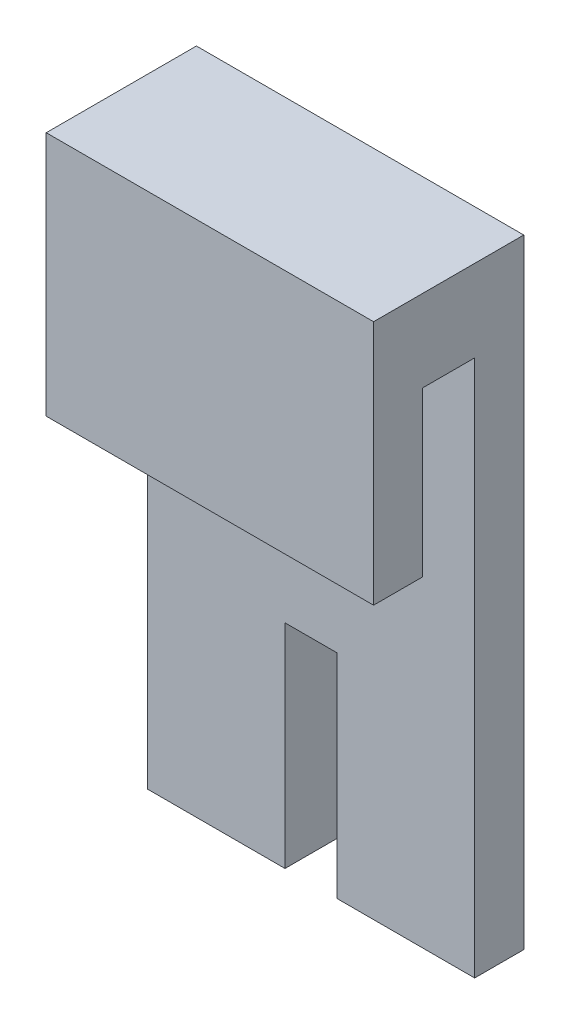
ISO-10303-21;
HEADER;
FILE_DESCRIPTION(('STEP AP214'),'2;1');
FILE_NAME('part.step','',(''),(''),'','','');
FILE_SCHEMA(('AUTOMOTIVE_DESIGN { 1 0 10303 214 1 1 1 1 }'));
ENDSEC;
DATA;
#1=APPLICATION_CONTEXT('core data for automotive mechanical design processes');
#2=APPLICATION_PROTOCOL_DEFINITION('international standard','automotive_design',2000,#1);
#3=PRODUCT_CONTEXT('',#1,'mechanical');
#4=PRODUCT('Part','Part','',(#3));
#5=PRODUCT_RELATED_PRODUCT_CATEGORY('part','',(#4));
#6=PRODUCT_DEFINITION_FORMATION('','',#4);
#7=PRODUCT_DEFINITION_CONTEXT('part definition',#1,'design');
#8=PRODUCT_DEFINITION('design','',#6,#7);
#9=PRODUCT_DEFINITION_SHAPE('','',#8);
#10=(LENGTH_UNIT() NAMED_UNIT(*) SI_UNIT(.MILLI.,.METRE.));
#11=(NAMED_UNIT(*) PLANE_ANGLE_UNIT() SI_UNIT($,.RADIAN.));
#12=(NAMED_UNIT(*) SI_UNIT($,.STERADIAN.) SOLID_ANGLE_UNIT());
#13=UNCERTAINTY_MEASURE_WITH_UNIT(LENGTH_MEASURE(1.E-05),#10,'distance_accuracy_value','');
#14=(GEOMETRIC_REPRESENTATION_CONTEXT(3) GLOBAL_UNCERTAINTY_ASSIGNED_CONTEXT((#13)) GLOBAL_UNIT_ASSIGNED_CONTEXT((#10,
#11,#12)) REPRESENTATION_CONTEXT('',''));
#15=CARTESIAN_POINT('',(0.,0.,0.));
#16=DIRECTION('',(0.,0.,1.));
#17=DIRECTION('',(1.,0.,0.));
#18=AXIS2_PLACEMENT_3D('',#15,#16,#17);
#19=CARTESIAN_POINT('',(20.,-22.812,-6.17500000000001));
#20=DIRECTION('',(0.,1.,0.));
#21=DIRECTION('',(0.,0.,1.));
#22=AXIS2_PLACEMENT_3D('',#19,#20,#21);
#23=PLANE('',#22);
#24=DIRECTION('',(0.,0.,1.));
#25=VECTOR('',#24,1.);
#26=CARTESIAN_POINT('',(8.4125,-22.812,-14.175));
#27=LINE('',#26,#25);
#28=CARTESIAN_POINT('',(8.4125,-22.812,-14.175));
#29=VERTEX_POINT('',#28);
#30=CARTESIAN_POINT('',(8.4125,-22.812,-6.17500000000001));
#31=VERTEX_POINT('',#30);
#32=EDGE_CURVE('E286',#29,#31,#27,.T.);
#33=ORIENTED_EDGE('',*,*,#32,.T.);
#34=DIRECTION('',(-1.,0.,0.));
#35=VECTOR('',#34,1.);
#36=CARTESIAN_POINT('',(20.,-22.812,-6.17500000000001));
#37=LINE('',#36,#35);
#38=CARTESIAN_POINT('',(0.,-22.812,-6.17500000000001));
#39=VERTEX_POINT('',#38);
#40=EDGE_CURVE('E184',#31,#39,#37,.T.);
#41=ORIENTED_EDGE('',*,*,#40,.T.);
#42=DIRECTION('',(0.,0.,-1.));
#43=VECTOR('',#42,1.);
#44=CARTESIAN_POINT('',(0.,-22.812,-6.17500000000001));
#45=LINE('',#44,#43);
#46=CARTESIAN_POINT('',(0.,-22.812,-9.17500000000001));
#47=VERTEX_POINT('',#46);
#48=EDGE_CURVE('E227',#39,#47,#45,.T.);
#49=ORIENTED_EDGE('',*,*,#48,.T.);
#50=DIRECTION('',(-1.,0.,0.));
#51=VECTOR('',#50,1.);
#52=CARTESIAN_POINT('',(20.,-22.812,-9.17500000000001));
#53=LINE('',#52,#51);
#54=CARTESIAN_POINT('',(5.4125,-22.812,-9.17500000000001));
#55=VERTEX_POINT('',#54);
#56=EDGE_CURVE('E245',#55,#47,#53,.T.);
#57=ORIENTED_EDGE('',*,*,#56,.F.);
#58=DIRECTION('',(0.,0.,1.));
#59=VECTOR('',#58,1.);
#60=CARTESIAN_POINT('',(5.4125,-22.812,-14.175));
#61=LINE('',#60,#59);
#62=CARTESIAN_POINT('',(5.4125,-22.812,-14.175));
#63=VERTEX_POINT('',#62);
#64=EDGE_CURVE('E282',#63,#55,#61,.T.);
#65=ORIENTED_EDGE('',*,*,#64,.F.);
#66=DIRECTION('',(-1.,0.,0.));
#67=VECTOR('',#66,1.);
#68=CARTESIAN_POINT('',(8.4125,-22.812,-14.175));
#69=LINE('',#68,#67);
#70=EDGE_CURVE('E349',#29,#63,#69,.T.);
#71=ORIENTED_EDGE('',*,*,#70,.F.);
#72=EDGE_LOOP('',(#33,#41,#49,#57,#65,#71));
#73=FACE_BOUND('',#72,.T.);
#74=ADVANCED_FACE('F39',(#73),#23,.F.);
#75=CARTESIAN_POINT('',(20.,-22.812,-9.17500000000001));
#76=DIRECTION('',(0.,0.,1.));
#77=DIRECTION('',(1.,0.,0.));
#78=AXIS2_PLACEMENT_3D('',#75,#76,#77);
#79=PLANE('',#78);
#80=DIRECTION('',(0.,-1.,0.));
#81=VECTOR('',#80,1.);
#82=CARTESIAN_POINT('',(14.5875,-6.81200000000001,-9.17500000000001));
#83=LINE('',#82,#81);
#84=CARTESIAN_POINT('',(14.5875,-6.81200000000001,-9.17500000000001));
#85=VERTEX_POINT('',#84);
#86=CARTESIAN_POINT('',(14.5875,-22.812,-9.17500000000001));
#87=VERTEX_POINT('',#86);
#88=EDGE_CURVE('E55',#85,#87,#83,.T.);
#89=ORIENTED_EDGE('',*,*,#88,.F.);
#90=DIRECTION('',(1.,0.,0.));
#91=VECTOR('',#90,1.);
#92=CARTESIAN_POINT('',(5.4125,-6.81200000000001,-9.17500000000001));
#93=LINE('',#92,#91);
#94=CARTESIAN_POINT('',(5.4125,-6.81200000000001,-9.17500000000001));
#95=VERTEX_POINT('',#94);
#96=EDGE_CURVE('E59',#95,#85,#93,.T.);
#97=ORIENTED_EDGE('',*,*,#96,.F.);
#98=DIRECTION('',(0.,1.,0.));
#99=VECTOR('',#98,1.);
#100=CARTESIAN_POINT('',(5.4125,-22.812,-9.17500000000001));
#101=LINE('',#100,#99);
#102=EDGE_CURVE('E177',#55,#95,#101,.T.);
#103=ORIENTED_EDGE('',*,*,#102,.F.);
#104=ORIENTED_EDGE('',*,*,#56,.T.);
#105=DIRECTION('',(0.,1.,0.));
#106=VECTOR('',#105,1.);
#107=CARTESIAN_POINT('',(0.,-22.812,-9.17500000000001));
#108=LINE('',#107,#106);
#109=CARTESIAN_POINT('',(0.,15.,-9.17500000000001));
#110=VERTEX_POINT('',#109);
#111=EDGE_CURVE('E231',#47,#110,#108,.T.);
#112=ORIENTED_EDGE('',*,*,#111,.T.);
#113=DIRECTION('',(-1.,0.,0.));
#114=VECTOR('',#113,1.);
#115=CARTESIAN_POINT('',(20.,15.,-9.17500000000001));
#116=LINE('',#115,#114);
#117=CARTESIAN_POINT('',(20.,15.,-9.17500000000001));
#118=VERTEX_POINT('',#117);
#119=EDGE_CURVE('E241',#118,#110,#116,.T.);
#120=ORIENTED_EDGE('',*,*,#119,.F.);
#121=DIRECTION('',(0.,1.,0.));
#122=VECTOR('',#121,1.);
#123=CARTESIAN_POINT('',(20.,-22.812,-9.17500000000001));
#124=LINE('',#123,#122);
#125=CARTESIAN_POINT('',(20.,-22.812,-9.17500000000001));
#126=VERTEX_POINT('',#125);
#127=EDGE_CURVE('E255',#126,#118,#124,.T.);
#128=ORIENTED_EDGE('',*,*,#127,.F.);
#129=EDGE_CURVE('E191',#126,#87,#53,.T.);
#130=ORIENTED_EDGE('',*,*,#129,.T.);
#131=EDGE_LOOP('',(#89,#97,#103,#104,#112,#120,#128,#130));
#132=FACE_BOUND('',#131,.T.);
#133=ADVANCED_FACE('F254',(#132),#79,.F.);
#134=CARTESIAN_POINT('',(20.,15.,0.));
#135=DIRECTION('',(0.,0.,-1.));
#136=DIRECTION('',(0.,1.,0.));
#137=AXIS2_PLACEMENT_3D('',#134,#135,#136);
#138=PLANE('',#137);
#139=DIRECTION('',(0.,-1.,0.));
#140=VECTOR('',#139,1.);
#141=CARTESIAN_POINT('',(0.,15.,0.));
#142=LINE('',#141,#140);
#143=CARTESIAN_POINT('',(0.,15.,0.));
#144=VERTEX_POINT('',#143);
#145=CARTESIAN_POINT('',(0.,0.,0.));
#146=VERTEX_POINT('',#145);
#147=EDGE_CURVE('E163',#144,#146,#142,.T.);
#148=ORIENTED_EDGE('',*,*,#147,.T.);
#149=DIRECTION('',(-1.,0.,0.));
#150=VECTOR('',#149,1.);
#151=CARTESIAN_POINT('',(20.,0.,0.));
#152=LINE('',#151,#150);
#153=CARTESIAN_POINT('',(20.,0.,0.));
#154=VERTEX_POINT('',#153);
#155=EDGE_CURVE('E11',#154,#146,#152,.T.);
#156=ORIENTED_EDGE('',*,*,#155,.F.);
#157=DIRECTION('',(0.,-1.,0.));
#158=VECTOR('',#157,1.);
#159=CARTESIAN_POINT('',(20.,15.,0.));
#160=LINE('',#159,#158);
#161=CARTESIAN_POINT('',(20.,15.,0.));
#162=VERTEX_POINT('',#161);
#163=EDGE_CURVE('E237',#162,#154,#160,.T.);
#164=ORIENTED_EDGE('',*,*,#163,.F.);
#165=DIRECTION('',(-1.,0.,0.));
#166=VECTOR('',#165,1.);
#167=CARTESIAN_POINT('',(20.,15.,0.));
#168=LINE('',#167,#166);
#169=EDGE_CURVE('E238',#162,#144,#168,.T.);
#170=ORIENTED_EDGE('',*,*,#169,.T.);
#171=EDGE_LOOP('',(#148,#156,#164,#170));
#172=FACE_BOUND('',#171,.T.);
#173=ADVANCED_FACE('F41',(#172),#138,.F.);
#174=CARTESIAN_POINT('',(20.,0.,0.));
#175=DIRECTION('',(0.,1.,0.));
#176=DIRECTION('',(0.,0.,1.));
#177=AXIS2_PLACEMENT_3D('',#174,#175,#176);
#178=PLANE('',#177);
#179=DIRECTION('',(0.,0.,-1.));
#180=VECTOR('',#179,1.);
#181=CARTESIAN_POINT('',(0.,0.,0.));
#182=LINE('',#181,#180);
#183=CARTESIAN_POINT('',(0.,0.,-3.));
#184=VERTEX_POINT('',#183);
#185=EDGE_CURVE('E212',#146,#184,#182,.T.);
#186=ORIENTED_EDGE('',*,*,#185,.T.);
#187=DIRECTION('',(-1.,0.,0.));
#188=VECTOR('',#187,1.);
#189=CARTESIAN_POINT('',(20.,0.,-3.));
#190=LINE('',#189,#188);
#191=CARTESIAN_POINT('',(20.,0.,-3.));
#192=VERTEX_POINT('',#191);
#193=EDGE_CURVE('E48',#192,#184,#190,.T.);
#194=ORIENTED_EDGE('',*,*,#193,.F.);
#195=DIRECTION('',(0.,0.,-1.));
#196=VECTOR('',#195,1.);
#197=CARTESIAN_POINT('',(20.,0.,0.));
#198=LINE('',#197,#196);
#199=EDGE_CURVE('E297',#154,#192,#198,.T.);
#200=ORIENTED_EDGE('',*,*,#199,.F.);
#201=ORIENTED_EDGE('',*,*,#155,.T.);
#202=EDGE_LOOP('',(#186,#194,#200,#201));
#203=FACE_BOUND('',#202,.T.);
#204=ADVANCED_FACE('F402',(#203),#178,.F.);
#205=CARTESIAN_POINT('',(20.,0.,-3.));
#206=DIRECTION('',(0.,0.,1.));
#207=DIRECTION('',(1.,0.,0.));
#208=AXIS2_PLACEMENT_3D('',#205,#206,#207);
#209=PLANE('',#208);
#210=DIRECTION('',(0.,1.,0.));
#211=VECTOR('',#210,1.);
#212=CARTESIAN_POINT('',(0.,0.,-3.));
#213=LINE('',#212,#211);
#214=CARTESIAN_POINT('',(0.,10.,-3.));
#215=VERTEX_POINT('',#214);
#216=EDGE_CURVE('E205',#184,#215,#213,.T.);
#217=ORIENTED_EDGE('',*,*,#216,.T.);
#218=DIRECTION('',(-1.,0.,0.));
#219=VECTOR('',#218,1.);
#220=CARTESIAN_POINT('',(20.,10.,-3.));
#221=LINE('',#220,#219);
#222=CARTESIAN_POINT('',(20.,10.,-3.));
#223=VERTEX_POINT('',#222);
#224=EDGE_CURVE('E189',#223,#215,#221,.T.);
#225=ORIENTED_EDGE('',*,*,#224,.F.);
#226=DIRECTION('',(0.,1.,0.));
#227=VECTOR('',#226,1.);
#228=CARTESIAN_POINT('',(20.,0.,-3.));
#229=LINE('',#228,#227);
#230=EDGE_CURVE('E206',#192,#223,#229,.T.);
#231=ORIENTED_EDGE('',*,*,#230,.F.);
#232=ORIENTED_EDGE('',*,*,#193,.T.);
#233=EDGE_LOOP('',(#217,#225,#231,#232));
#234=FACE_BOUND('',#233,.T.);
#235=ADVANCED_FACE('F203',(#234),#209,.F.);
#236=CARTESIAN_POINT('',(20.,10.,-3.));
#237=DIRECTION('',(0.,1.,0.));
#238=DIRECTION('',(0.,0.,1.));
#239=AXIS2_PLACEMENT_3D('',#236,#237,#238);
#240=PLANE('',#239);
#241=DIRECTION('',(0.,0.,-1.));
#242=VECTOR('',#241,1.);
#243=CARTESIAN_POINT('',(0.,10.,-3.));
#244=LINE('',#243,#242);
#245=CARTESIAN_POINT('',(0.,10.,-6.175));
#246=VERTEX_POINT('',#245);
#247=EDGE_CURVE('E214',#215,#246,#244,.T.);
#248=ORIENTED_EDGE('',*,*,#247,.T.);
#249=DIRECTION('',(-1.,0.,0.));
#250=VECTOR('',#249,1.);
#251=CARTESIAN_POINT('',(20.,10.,-6.175));
#252=LINE('',#251,#250);
#253=CARTESIAN_POINT('',(20.,10.,-6.175));
#254=VERTEX_POINT('',#253);
#255=EDGE_CURVE('E183',#254,#246,#252,.T.);
#256=ORIENTED_EDGE('',*,*,#255,.F.);
#257=DIRECTION('',(0.,0.,-1.));
#258=VECTOR('',#257,1.);
#259=CARTESIAN_POINT('',(20.,10.,-3.));
#260=LINE('',#259,#258);
#261=EDGE_CURVE('E302',#223,#254,#260,.T.);
#262=ORIENTED_EDGE('',*,*,#261,.F.);
#263=ORIENTED_EDGE('',*,*,#224,.T.);
#264=EDGE_LOOP('',(#248,#256,#262,#263));
#265=FACE_BOUND('',#264,.T.);
#266=ADVANCED_FACE('F395',(#265),#240,.F.);
#267=CARTESIAN_POINT('',(20.,10.,-6.175));
#268=DIRECTION('',(0.,0.,-1.));
#269=DIRECTION('',(0.,1.,0.));
#270=AXIS2_PLACEMENT_3D('',#267,#268,#269);
#271=PLANE('',#270);
#272=ORIENTED_EDGE('',*,*,#40,.F.);
#273=DIRECTION('',(0.,-1.,0.));
#274=VECTOR('',#273,1.);
#275=CARTESIAN_POINT('',(8.4125,-22.812,-6.17500000000001));
#276=LINE('',#275,#274);
#277=CARTESIAN_POINT('',(8.4125,-9.81199999999999,-6.175));
#278=VERTEX_POINT('',#277);
#279=EDGE_CURVE('E332',#278,#31,#276,.T.);
#280=ORIENTED_EDGE('',*,*,#279,.F.);
#281=DIRECTION('',(-1.,0.,0.));
#282=VECTOR('',#281,1.);
#283=CARTESIAN_POINT('',(8.4125,-9.81199999999999,-6.175));
#284=LINE('',#283,#282);
#285=CARTESIAN_POINT('',(11.5875,-9.81199999999999,-6.175));
#286=VERTEX_POINT('',#285);
#287=EDGE_CURVE('E175',#286,#278,#284,.T.);
#288=ORIENTED_EDGE('',*,*,#287,.F.);
#289=DIRECTION('',(0.,1.,0.));
#290=VECTOR('',#289,1.);
#291=CARTESIAN_POINT('',(11.5875,-9.81199999999999,-6.175));
#292=LINE('',#291,#290);
#293=CARTESIAN_POINT('',(11.5875,-22.812,-6.17500000000001));
#294=VERTEX_POINT('',#293);
#295=EDGE_CURVE('E155',#294,#286,#292,.T.);
#296=ORIENTED_EDGE('',*,*,#295,.F.);
#297=CARTESIAN_POINT('',(20.,-22.812,-6.17500000000001));
#298=VERTEX_POINT('',#297);
#299=EDGE_CURVE('E171',#298,#294,#37,.T.);
#300=ORIENTED_EDGE('',*,*,#299,.F.);
#301=DIRECTION('',(0.,-1.,0.));
#302=VECTOR('',#301,1.);
#303=CARTESIAN_POINT('',(20.,10.,-6.175));
#304=LINE('',#303,#302);
#305=EDGE_CURVE('E305',#254,#298,#304,.T.);
#306=ORIENTED_EDGE('',*,*,#305,.F.);
#307=ORIENTED_EDGE('',*,*,#255,.T.);
#308=DIRECTION('',(0.,-1.,0.));
#309=VECTOR('',#308,1.);
#310=CARTESIAN_POINT('',(0.,10.,-6.175));
#311=LINE('',#310,#309);
#312=EDGE_CURVE('E219',#246,#39,#311,.T.);
#313=ORIENTED_EDGE('',*,*,#312,.T.);
#314=EDGE_LOOP('',(#272,#280,#288,#296,#300,#306,#307,#313));
#315=FACE_BOUND('',#314,.T.);
#316=ADVANCED_FACE('F169',(#315),#271,.F.);
#317=ORIENTED_EDGE('',*,*,#299,.T.);
#318=DIRECTION('',(0.,0.,1.));
#319=VECTOR('',#318,1.);
#320=CARTESIAN_POINT('',(11.5875,-22.812,-14.175));
#321=LINE('',#320,#319);
#322=CARTESIAN_POINT('',(11.5875,-22.812,-14.175));
#323=VERTEX_POINT('',#322);
#324=EDGE_CURVE('E151',#323,#294,#321,.T.);
#325=ORIENTED_EDGE('',*,*,#324,.F.);
#326=DIRECTION('',(-1.,0.,0.));
#327=VECTOR('',#326,1.);
#328=CARTESIAN_POINT('',(14.5875,-22.812,-14.175));
#329=LINE('',#328,#327);
#330=CARTESIAN_POINT('',(14.5875,-22.812,-14.175));
#331=VERTEX_POINT('',#330);
#332=EDGE_CURVE('E266',#331,#323,#329,.T.);
#333=ORIENTED_EDGE('',*,*,#332,.F.);
#334=DIRECTION('',(0.,0.,1.));
#335=VECTOR('',#334,1.);
#336=CARTESIAN_POINT('',(14.5875,-22.812,-14.175));
#337=LINE('',#336,#335);
#338=EDGE_CURVE('E262',#331,#87,#337,.T.);
#339=ORIENTED_EDGE('',*,*,#338,.T.);
#340=ORIENTED_EDGE('',*,*,#129,.F.);
#341=DIRECTION('',(0.,0.,-1.));
#342=VECTOR('',#341,1.);
#343=CARTESIAN_POINT('',(20.,-22.812,-6.17500000000001));
#344=LINE('',#343,#342);
#345=EDGE_CURVE('E181',#298,#126,#344,.T.);
#346=ORIENTED_EDGE('',*,*,#345,.F.);
#347=EDGE_LOOP('',(#317,#325,#333,#339,#340,#346));
#348=FACE_BOUND('',#347,.T.);
#349=ADVANCED_FACE('F179',(#348),#23,.F.);
#350=CARTESIAN_POINT('',(20.,15.,-9.17500000000001));
#351=DIRECTION('',(0.,-1.,0.));
#352=DIRECTION('',(0.,0.,-1.));
#353=AXIS2_PLACEMENT_3D('',#350,#351,#352);
#354=PLANE('',#353);
#355=DIRECTION('',(0.,0.,1.));
#356=VECTOR('',#355,1.);
#357=CARTESIAN_POINT('',(0.,15.,-9.17500000000001));
#358=LINE('',#357,#356);
#359=EDGE_CURVE('E234',#110,#144,#358,.T.);
#360=ORIENTED_EDGE('',*,*,#359,.T.);
#361=ORIENTED_EDGE('',*,*,#169,.F.);
#362=DIRECTION('',(0.,0.,1.));
#363=VECTOR('',#362,1.);
#364=CARTESIAN_POINT('',(20.,15.,-9.17500000000001));
#365=LINE('',#364,#363);
#366=EDGE_CURVE('E242',#118,#162,#365,.T.);
#367=ORIENTED_EDGE('',*,*,#366,.F.);
#368=ORIENTED_EDGE('',*,*,#119,.T.);
#369=EDGE_LOOP('',(#360,#361,#367,#368));
#370=FACE_BOUND('',#369,.T.);
#371=ADVANCED_FACE('F321',(#370),#354,.F.);
#372=CARTESIAN_POINT('',(20.,0.,0.));
#373=DIRECTION('',(1.,0.,0.));
#374=DIRECTION('',(0.,0.,-1.));
#375=AXIS2_PLACEMENT_3D('',#372,#373,#374);
#376=PLANE('',#375);
#377=ORIENTED_EDGE('',*,*,#163,.T.);
#378=ORIENTED_EDGE('',*,*,#199,.T.);
#379=ORIENTED_EDGE('',*,*,#230,.T.);
#380=ORIENTED_EDGE('',*,*,#261,.T.);
#381=ORIENTED_EDGE('',*,*,#305,.T.);
#382=ORIENTED_EDGE('',*,*,#345,.T.);
#383=ORIENTED_EDGE('',*,*,#127,.T.);
#384=ORIENTED_EDGE('',*,*,#366,.T.);
#385=EDGE_LOOP('',(#377,#378,#379,#380,#381,#382,#383,#384));
#386=FACE_BOUND('',#385,.T.);
#387=ADVANCED_FACE('F323',(#386),#376,.T.);
#388=CARTESIAN_POINT('',(0.,0.,0.));
#389=DIRECTION('',(1.,0.,0.));
#390=DIRECTION('',(0.,0.,-1.));
#391=AXIS2_PLACEMENT_3D('',#388,#389,#390);
#392=PLANE('',#391);
#393=ORIENTED_EDGE('',*,*,#147,.F.);
#394=ORIENTED_EDGE('',*,*,#359,.F.);
#395=ORIENTED_EDGE('',*,*,#111,.F.);
#396=ORIENTED_EDGE('',*,*,#48,.F.);
#397=ORIENTED_EDGE('',*,*,#312,.F.);
#398=ORIENTED_EDGE('',*,*,#247,.F.);
#399=ORIENTED_EDGE('',*,*,#216,.F.);
#400=ORIENTED_EDGE('',*,*,#185,.F.);
#401=EDGE_LOOP('',(#393,#394,#395,#396,#397,#398,#399,#400));
#402=FACE_BOUND('',#401,.T.);
#403=ADVANCED_FACE('F211',(#402),#392,.F.);
#404=CARTESIAN_POINT('',(11.5875,-22.812,-14.175));
#405=DIRECTION('',(1.,0.,0.));
#406=DIRECTION('',(0.,0.,-1.));
#407=AXIS2_PLACEMENT_3D('',#404,#405,#406);
#408=PLANE('',#407);
#409=ORIENTED_EDGE('',*,*,#324,.T.);
#410=ORIENTED_EDGE('',*,*,#295,.T.);
#411=DIRECTION('',(0.,0.,1.));
#412=VECTOR('',#411,1.);
#413=CARTESIAN_POINT('',(11.5875,-9.81199999999999,-14.175));
#414=LINE('',#413,#412);
#415=CARTESIAN_POINT('',(11.5875,-9.81199999999999,-14.175));
#416=VERTEX_POINT('',#415);
#417=EDGE_CURVE('E164',#416,#286,#414,.T.);
#418=ORIENTED_EDGE('',*,*,#417,.F.);
#419=DIRECTION('',(0.,1.,0.));
#420=VECTOR('',#419,1.);
#421=CARTESIAN_POINT('',(11.5875,-22.812,-14.175));
#422=LINE('',#421,#420);
#423=EDGE_CURVE('E157',#323,#416,#422,.T.);
#424=ORIENTED_EDGE('',*,*,#423,.F.);
#425=EDGE_LOOP('',(#409,#410,#418,#424));
#426=FACE_BOUND('',#425,.T.);
#427=ADVANCED_FACE('F153',(#426),#408,.F.);
#428=CARTESIAN_POINT('',(11.5875,-9.81199999999999,-14.175));
#429=DIRECTION('',(0.,1.,0.));
#430=DIRECTION('',(0.,0.,1.));
#431=AXIS2_PLACEMENT_3D('',#428,#429,#430);
#432=PLANE('',#431);
#433=ORIENTED_EDGE('',*,*,#417,.T.);
#434=ORIENTED_EDGE('',*,*,#287,.T.);
#435=DIRECTION('',(0.,0.,1.));
#436=VECTOR('',#435,1.);
#437=CARTESIAN_POINT('',(8.4125,-9.81199999999999,-14.175));
#438=LINE('',#437,#436);
#439=CARTESIAN_POINT('',(8.4125,-9.81199999999999,-14.175));
#440=VERTEX_POINT('',#439);
#441=EDGE_CURVE('E289',#440,#278,#438,.T.);
#442=ORIENTED_EDGE('',*,*,#441,.F.);
#443=DIRECTION('',(-1.,0.,0.));
#444=VECTOR('',#443,1.);
#445=CARTESIAN_POINT('',(11.5875,-9.81199999999999,-14.175));
#446=LINE('',#445,#444);
#447=EDGE_CURVE('E343',#416,#440,#446,.T.);
#448=ORIENTED_EDGE('',*,*,#447,.F.);
#449=EDGE_LOOP('',(#433,#434,#442,#448));
#450=FACE_BOUND('',#449,.T.);
#451=ADVANCED_FACE('F373',(#450),#432,.F.);
#452=CARTESIAN_POINT('',(8.4125,-9.81199999999999,-14.175));
#453=DIRECTION('',(-1.,0.,0.));
#454=DIRECTION('',(0.,0.,1.));
#455=AXIS2_PLACEMENT_3D('',#452,#453,#454);
#456=PLANE('',#455);
#457=ORIENTED_EDGE('',*,*,#441,.T.);
#458=ORIENTED_EDGE('',*,*,#279,.T.);
#459=ORIENTED_EDGE('',*,*,#32,.F.);
#460=DIRECTION('',(0.,-1.,0.));
#461=VECTOR('',#460,1.);
#462=CARTESIAN_POINT('',(8.4125,-9.81199999999999,-14.175));
#463=LINE('',#462,#461);
#464=EDGE_CURVE('E346',#440,#29,#463,.T.);
#465=ORIENTED_EDGE('',*,*,#464,.F.);
#466=EDGE_LOOP('',(#457,#458,#459,#465));
#467=FACE_BOUND('',#466,.T.);
#468=ADVANCED_FACE('F371',(#467),#456,.F.);
#469=CARTESIAN_POINT('',(5.4125,-22.812,-14.175));
#470=DIRECTION('',(1.,0.,0.));
#471=DIRECTION('',(0.,0.,-1.));
#472=AXIS2_PLACEMENT_3D('',#469,#470,#471);
#473=PLANE('',#472);
#474=ORIENTED_EDGE('',*,*,#102,.T.);
#475=DIRECTION('',(0.,0.,1.));
#476=VECTOR('',#475,1.);
#477=CARTESIAN_POINT('',(5.4125,-6.81200000000001,-14.175));
#478=LINE('',#477,#476);
#479=CARTESIAN_POINT('',(5.4125,-6.81200000000001,-14.175));
#480=VERTEX_POINT('',#479);
#481=EDGE_CURVE('E273',#480,#95,#478,.T.);
#482=ORIENTED_EDGE('',*,*,#481,.F.);
#483=DIRECTION('',(0.,1.,0.));
#484=VECTOR('',#483,1.);
#485=CARTESIAN_POINT('',(5.4125,-22.812,-14.175));
#486=LINE('',#485,#484);
#487=EDGE_CURVE('E352',#63,#480,#486,.T.);
#488=ORIENTED_EDGE('',*,*,#487,.F.);
#489=ORIENTED_EDGE('',*,*,#64,.T.);
#490=EDGE_LOOP('',(#474,#482,#488,#489));
#491=FACE_BOUND('',#490,.T.);
#492=ADVANCED_FACE('F365',(#491),#473,.F.);
#493=CARTESIAN_POINT('',(5.4125,-6.81200000000001,-14.175));
#494=DIRECTION('',(0.,-1.,0.));
#495=DIRECTION('',(1.,0.,0.));
#496=AXIS2_PLACEMENT_3D('',#493,#494,#495);
#497=PLANE('',#496);
#498=ORIENTED_EDGE('',*,*,#96,.T.);
#499=DIRECTION('',(0.,0.,1.));
#500=VECTOR('',#499,1.);
#501=CARTESIAN_POINT('',(14.5875,-6.81200000000001,-14.175));
#502=LINE('',#501,#500);
#503=CARTESIAN_POINT('',(14.5875,-6.81200000000001,-14.175));
#504=VERTEX_POINT('',#503);
#505=EDGE_CURVE('E264',#504,#85,#502,.T.);
#506=ORIENTED_EDGE('',*,*,#505,.F.);
#507=DIRECTION('',(1.,0.,0.));
#508=VECTOR('',#507,1.);
#509=CARTESIAN_POINT('',(5.4125,-6.81200000000001,-14.175));
#510=LINE('',#509,#508);
#511=EDGE_CURVE('E275',#480,#504,#510,.T.);
#512=ORIENTED_EDGE('',*,*,#511,.F.);
#513=ORIENTED_EDGE('',*,*,#481,.T.);
#514=EDGE_LOOP('',(#498,#506,#512,#513));
#515=FACE_BOUND('',#514,.T.);
#516=ADVANCED_FACE('F360',(#515),#497,.F.);
#517=CARTESIAN_POINT('',(14.5875,-6.81200000000001,-14.175));
#518=DIRECTION('',(-1.,0.,0.));
#519=DIRECTION('',(0.,-1.,0.));
#520=AXIS2_PLACEMENT_3D('',#517,#518,#519);
#521=PLANE('',#520);
#522=ORIENTED_EDGE('',*,*,#88,.T.);
#523=ORIENTED_EDGE('',*,*,#338,.F.);
#524=DIRECTION('',(0.,-1.,0.));
#525=VECTOR('',#524,1.);
#526=CARTESIAN_POINT('',(14.5875,-6.81200000000001,-14.175));
#527=LINE('',#526,#525);
#528=EDGE_CURVE('E269',#504,#331,#527,.T.);
#529=ORIENTED_EDGE('',*,*,#528,.F.);
#530=ORIENTED_EDGE('',*,*,#505,.T.);
#531=EDGE_LOOP('',(#522,#523,#529,#530));
#532=FACE_BOUND('',#531,.T.);
#533=ADVANCED_FACE('F260',(#532),#521,.F.);
#534=CARTESIAN_POINT('',(0.,0.,-14.175));
#535=DIRECTION('',(0.,0.,-1.));
#536=DIRECTION('',(-1.,0.,0.));
#537=AXIS2_PLACEMENT_3D('',#534,#535,#536);
#538=PLANE('',#537);
#539=ORIENTED_EDGE('',*,*,#332,.T.);
#540=ORIENTED_EDGE('',*,*,#423,.T.);
#541=ORIENTED_EDGE('',*,*,#447,.T.);
#542=ORIENTED_EDGE('',*,*,#464,.T.);
#543=ORIENTED_EDGE('',*,*,#70,.T.);
#544=ORIENTED_EDGE('',*,*,#487,.T.);
#545=ORIENTED_EDGE('',*,*,#511,.T.);
#546=ORIENTED_EDGE('',*,*,#528,.T.);
#547=EDGE_LOOP('',(#539,#540,#541,#542,#543,#544,#545,#546));
#548=FACE_BOUND('',#547,.T.);
#549=ADVANCED_FACE('F367',(#548),#538,.T.);
#550=CLOSED_SHELL('',(#74,#133,#173,#204,#235,#266,#316,#349,#371,#387,#403,#427,#451,#468,#492,
#516,#533,#549));
#551=MANIFOLD_SOLID_BREP('B2',#550);
#552=ADVANCED_BREP_SHAPE_REPRESENTATION('',(#18,#551),#14);
#553=SHAPE_DEFINITION_REPRESENTATION(#9,#552);
ENDSEC;
END-ISO-10303-21;
